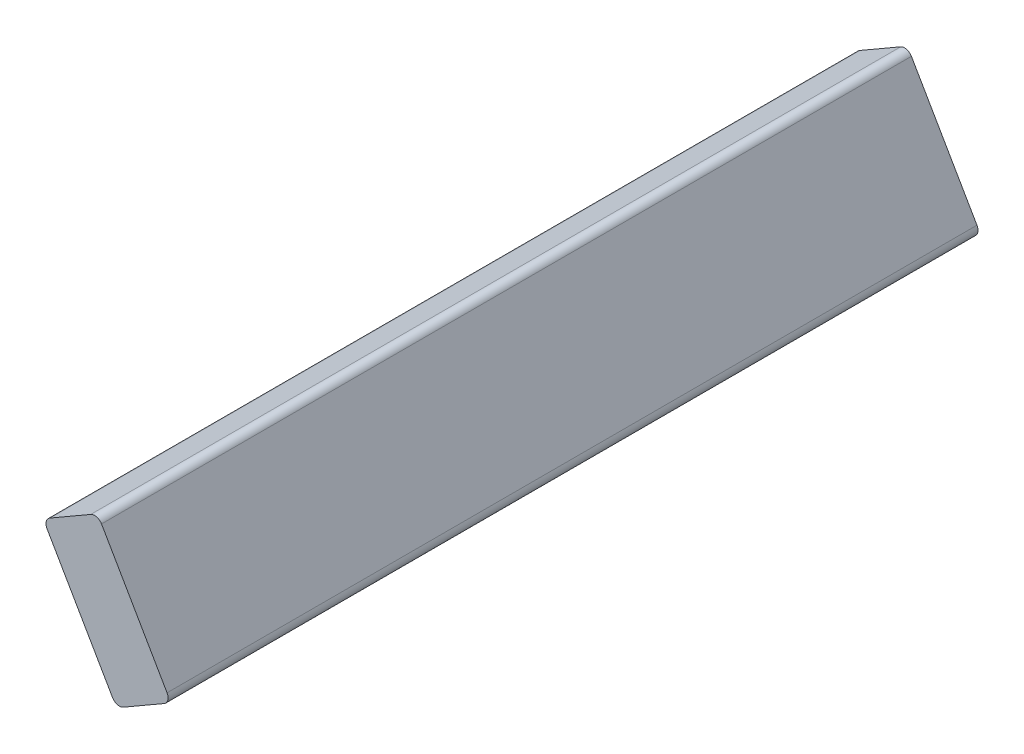
ISO-10303-21;
HEADER;
FILE_DESCRIPTION(('STEP AP214'),'2;1');
FILE_NAME('part.step','',(''),(''),'','','');
FILE_SCHEMA(('AUTOMOTIVE_DESIGN { 1 0 10303 214 1 1 1 1 }'));
ENDSEC;
DATA;
#1=APPLICATION_CONTEXT('core data for automotive mechanical design processes');
#2=APPLICATION_PROTOCOL_DEFINITION('international standard','automotive_design',2000,#1);
#3=PRODUCT_CONTEXT('',#1,'mechanical');
#4=PRODUCT('Part','Part','',(#3));
#5=PRODUCT_RELATED_PRODUCT_CATEGORY('part','',(#4));
#6=PRODUCT_DEFINITION_FORMATION('','',#4);
#7=PRODUCT_DEFINITION_CONTEXT('part definition',#1,'design');
#8=PRODUCT_DEFINITION('design','',#6,#7);
#9=PRODUCT_DEFINITION_SHAPE('','',#8);
#10=(LENGTH_UNIT() NAMED_UNIT(*) SI_UNIT(.MILLI.,.METRE.));
#11=(NAMED_UNIT(*) PLANE_ANGLE_UNIT() SI_UNIT($,.RADIAN.));
#12=(NAMED_UNIT(*) SI_UNIT($,.STERADIAN.) SOLID_ANGLE_UNIT());
#13=UNCERTAINTY_MEASURE_WITH_UNIT(LENGTH_MEASURE(1.E-05),#10,'distance_accuracy_value','');
#14=(GEOMETRIC_REPRESENTATION_CONTEXT(3) GLOBAL_UNCERTAINTY_ASSIGNED_CONTEXT((#13)) GLOBAL_UNIT_ASSIGNED_CONTEXT((#10,
#11,#12)) REPRESENTATION_CONTEXT('',''));
#15=CARTESIAN_POINT('',(0.,0.,0.));
#16=DIRECTION('',(0.,0.,1.));
#17=DIRECTION('',(1.,0.,0.));
#18=AXIS2_PLACEMENT_3D('',#15,#16,#17);
#19=CARTESIAN_POINT('',(0.,0.,0.));
#20=DIRECTION('',(0.,0.,1.));
#21=DIRECTION('',(1.,0.,0.));
#22=AXIS2_PLACEMENT_3D('',#19,#20,#21);
#23=PLANE('',#22);
#24=DIRECTION('',(0.866025403784439,0.5,0.));
#25=VECTOR('',#24,1.);
#26=CARTESIAN_POINT('',(227.693380196504,-470.576503047442,0.));
#27=LINE('',#26,#25);
#28=CARTESIAN_POINT('',(231.817826182027,-468.195253047442,0.));
#29=VERTEX_POINT('',#28);
#30=CARTESIAN_POINT('',(256.564502095168,-453.907753047442,0.));
#31=VERTEX_POINT('',#30);
#32=EDGE_CURVE('E106',#29,#31,#27,.T.);
#33=ORIENTED_EDGE('',*,*,#32,.F.);
#34=CARTESIAN_POINT('',(229.436576182027,-464.070807061918,0.));
#35=DIRECTION('',(0.,0.,1.));
#36=DIRECTION('',(1.,0.,0.));
#37=AXIS2_PLACEMENT_3D('',#34,#35,#36);
#38=CIRCLE('',#37,4.7625);
#39=CARTESIAN_POINT('',(225.312130196504,-466.452057061918,0.));
#40=VERTEX_POINT('',#39);
#41=EDGE_CURVE('E161',#29,#40,#38,.F.);
#42=ORIENTED_EDGE('',*,*,#41,.T.);
#43=DIRECTION('',(0.5,-0.866025403784439,0.));
#44=VECTOR('',#43,1.);
#45=CARTESIAN_POINT('',(227.693380196504,-470.576503047442,0.));
#46=LINE('',#45,#44);
#47=CARTESIAN_POINT('',(185.624630196504,-397.711290636529,0.));
#48=VERTEX_POINT('',#47);
#49=EDGE_CURVE('E146',#48,#40,#46,.T.);
#50=ORIENTED_EDGE('',*,*,#49,.F.);
#51=CARTESIAN_POINT('',(189.749076182027,-395.330040636529,0.));
#52=DIRECTION('',(0.,0.,1.));
#53=DIRECTION('',(1.,0.,0.));
#54=AXIS2_PLACEMENT_3D('',#51,#52,#53);
#55=CIRCLE('',#54,4.7625);
#56=CARTESIAN_POINT('',(187.367826182027,-391.205594651005,0.));
#57=VERTEX_POINT('',#56);
#58=EDGE_CURVE('E159',#48,#57,#55,.F.);
#59=ORIENTED_EDGE('',*,*,#58,.T.);
#60=DIRECTION('',(-0.866025403784438,-0.5,0.));
#61=VECTOR('',#60,1.);
#62=CARTESIAN_POINT('',(183.243380196504,-393.586844651005,0.));
#63=LINE('',#62,#61);
#64=CARTESIAN_POINT('',(212.114502095168,-376.918094651005,0.));
#65=VERTEX_POINT('',#64);
#66=EDGE_CURVE('E144',#65,#57,#63,.T.);
#67=ORIENTED_EDGE('',*,*,#66,.F.);
#68=CARTESIAN_POINT('',(214.495752095167,-381.042540636529,0.));
#69=DIRECTION('',(0.,0.,1.));
#70=DIRECTION('',(1.,0.,0.));
#71=AXIS2_PLACEMENT_3D('',#68,#69,#70);
#72=CIRCLE('',#71,4.7625);
#73=CARTESIAN_POINT('',(218.620198080691,-378.661290636529,0.));
#74=VERTEX_POINT('',#73);
#75=EDGE_CURVE('E143',#65,#74,#72,.F.);
#76=ORIENTED_EDGE('',*,*,#75,.T.);
#77=DIRECTION('',(-0.5,0.866025403784439,0.));
#78=VECTOR('',#77,1.);
#79=CARTESIAN_POINT('',(260.688948080691,-451.526503047442,0.));
#80=LINE('',#79,#78);
#81=CARTESIAN_POINT('',(258.307698080691,-447.402057061918,0.));
#82=VERTEX_POINT('',#81);
#83=EDGE_CURVE('E138',#82,#74,#80,.T.);
#84=ORIENTED_EDGE('',*,*,#83,.F.);
#85=CARTESIAN_POINT('',(254.183252095168,-449.783307061918,0.));
#86=DIRECTION('',(0.,0.,1.));
#87=DIRECTION('',(1.,0.,0.));
#88=AXIS2_PLACEMENT_3D('',#85,#86,#87);
#89=CIRCLE('',#88,4.7625);
#90=EDGE_CURVE('E141',#82,#31,#89,.F.);
#91=ORIENTED_EDGE('',*,*,#90,.T.);
#92=EDGE_LOOP('',(#33,#42,#50,#59,#67,#76,#84,#91));
#93=FACE_BOUND('',#92,.T.);
#94=ADVANCED_FACE('F32',(#93),#23,.F.);
#95=CARTESIAN_POINT('',(227.693380196504,-470.576503047442,613.913128567367));
#96=DIRECTION('',(0.866025403784439,0.5,0.));
#97=DIRECTION('',(-0.5,0.866025403784439,0.));
#98=AXIS2_PLACEMENT_3D('',#95,#96,#97);
#99=PLANE('',#98);
#100=ORIENTED_EDGE('',*,*,#49,.T.);
#101=DIRECTION('',(0.,0.,-1.));
#102=VECTOR('',#101,1.);
#103=CARTESIAN_POINT('',(225.312130196504,-466.452057061918,613.913128567367));
#104=LINE('',#103,#102);
#105=CARTESIAN_POINT('',(225.312130196504,-466.452057061918,490.53796101));
#106=VERTEX_POINT('',#105);
#107=EDGE_CURVE('E121',#40,#106,#104,.F.);
#108=ORIENTED_EDGE('',*,*,#107,.T.);
#109=DIRECTION('',(-0.5,0.866025403784439,0.));
#110=VECTOR('',#109,1.);
#111=CARTESIAN_POINT('',(227.693380196504,-470.576503047442,490.53796101));
#112=LINE('',#111,#110);
#113=CARTESIAN_POINT('',(185.624630196504,-397.711290636529,490.53796101));
#114=VERTEX_POINT('',#113);
#115=EDGE_CURVE('E152',#106,#114,#112,.T.);
#116=ORIENTED_EDGE('',*,*,#115,.T.);
#117=DIRECTION('',(0.,0.,-1.));
#118=VECTOR('',#117,1.);
#119=CARTESIAN_POINT('',(185.624630196504,-397.711290636529,613.913128567367));
#120=LINE('',#119,#118);
#121=EDGE_CURVE('E125',#114,#48,#120,.T.);
#122=ORIENTED_EDGE('',*,*,#121,.T.);
#123=EDGE_LOOP('',(#100,#108,#116,#122));
#124=FACE_BOUND('',#123,.T.);
#125=ADVANCED_FACE('F166',(#124),#99,.F.);
#126=CARTESIAN_POINT('',(183.243380196504,-393.586844651005,613.913128567367));
#127=DIRECTION('',(0.5,-0.866025403784438,0.));
#128=DIRECTION('',(0.866025403784439,0.5,0.));
#129=AXIS2_PLACEMENT_3D('',#126,#127,#128);
#130=PLANE('',#129);
#131=ORIENTED_EDGE('',*,*,#66,.T.);
#132=DIRECTION('',(0.,0.,-1.));
#133=VECTOR('',#132,1.);
#134=CARTESIAN_POINT('',(187.367826182027,-391.205594651005,613.913128567367));
#135=LINE('',#134,#133);
#136=CARTESIAN_POINT('',(187.367826182027,-391.205594651005,490.53796101));
#137=VERTEX_POINT('',#136);
#138=EDGE_CURVE('E54',#57,#137,#135,.F.);
#139=ORIENTED_EDGE('',*,*,#138,.T.);
#140=DIRECTION('',(0.866025403784439,0.5,0.));
#141=VECTOR('',#140,1.);
#142=CARTESIAN_POINT('',(183.243380196504,-393.586844651005,490.53796101));
#143=LINE('',#142,#141);
#144=CARTESIAN_POINT('',(212.114502095168,-376.918094651005,490.53796101));
#145=VERTEX_POINT('',#144);
#146=EDGE_CURVE('E154',#137,#145,#143,.T.);
#147=ORIENTED_EDGE('',*,*,#146,.T.);
#148=DIRECTION('',(0.,0.,-1.));
#149=VECTOR('',#148,1.);
#150=CARTESIAN_POINT('',(212.114502095168,-376.918094651005,613.913128567367));
#151=LINE('',#150,#149);
#152=EDGE_CURVE('E131',#145,#65,#151,.T.);
#153=ORIENTED_EDGE('',*,*,#152,.T.);
#154=EDGE_LOOP('',(#131,#139,#147,#153));
#155=FACE_BOUND('',#154,.T.);
#156=ADVANCED_FACE('F187',(#155),#130,.F.);
#157=CARTESIAN_POINT('',(260.688948080691,-451.526503047442,613.913128567367));
#158=DIRECTION('',(-0.866025403784439,-0.5,0.));
#159=DIRECTION('',(0.5,-0.866025403784439,0.));
#160=AXIS2_PLACEMENT_3D('',#157,#158,#159);
#161=PLANE('',#160);
#162=ORIENTED_EDGE('',*,*,#83,.T.);
#163=DIRECTION('',(0.,0.,-1.));
#164=VECTOR('',#163,1.);
#165=CARTESIAN_POINT('',(218.620198080691,-378.661290636529,613.913128567367));
#166=LINE('',#165,#164);
#167=CARTESIAN_POINT('',(218.620198080691,-378.661290636529,490.53796101));
#168=VERTEX_POINT('',#167);
#169=EDGE_CURVE('E11',#74,#168,#166,.F.);
#170=ORIENTED_EDGE('',*,*,#169,.T.);
#171=DIRECTION('',(0.5,-0.866025403784439,0.));
#172=VECTOR('',#171,1.);
#173=CARTESIAN_POINT('',(260.688948080691,-451.526503047442,490.53796101));
#174=LINE('',#173,#172);
#175=CARTESIAN_POINT('',(258.307698080691,-447.402057061918,490.53796101));
#176=VERTEX_POINT('',#175);
#177=EDGE_CURVE('E117',#168,#176,#174,.T.);
#178=ORIENTED_EDGE('',*,*,#177,.T.);
#179=DIRECTION('',(0.,0.,-1.));
#180=VECTOR('',#179,1.);
#181=CARTESIAN_POINT('',(258.307698080691,-447.402057061918,613.913128567367));
#182=LINE('',#181,#180);
#183=EDGE_CURVE('E40',#176,#82,#182,.T.);
#184=ORIENTED_EDGE('',*,*,#183,.T.);
#185=EDGE_LOOP('',(#162,#170,#178,#184));
#186=FACE_BOUND('',#185,.T.);
#187=ADVANCED_FACE('F137',(#186),#161,.F.);
#188=CARTESIAN_POINT('',(227.693380196504,-470.576503047442,613.913128567367));
#189=DIRECTION('',(-0.5,0.866025403784439,0.));
#190=DIRECTION('',(-0.866025403784439,-0.5,0.));
#191=AXIS2_PLACEMENT_3D('',#188,#189,#190);
#192=PLANE('',#191);
#193=DIRECTION('',(-0.866025403784439,-0.5,0.));
#194=VECTOR('',#193,1.);
#195=CARTESIAN_POINT('',(227.693380196504,-470.576503047442,490.53796101));
#196=LINE('',#195,#194);
#197=CARTESIAN_POINT('',(256.564502095168,-453.907753047442,490.53796101));
#198=VERTEX_POINT('',#197);
#199=CARTESIAN_POINT('',(231.817826182027,-468.195253047442,490.53796101));
#200=VERTEX_POINT('',#199);
#201=EDGE_CURVE('E103',#198,#200,#196,.T.);
#202=ORIENTED_EDGE('',*,*,#201,.T.);
#203=DIRECTION('',(0.,0.,-1.));
#204=VECTOR('',#203,1.);
#205=CARTESIAN_POINT('',(231.817826182027,-468.195253047442,613.913128567367));
#206=LINE('',#205,#204);
#207=EDGE_CURVE('E109',#200,#29,#206,.T.);
#208=ORIENTED_EDGE('',*,*,#207,.T.);
#209=ORIENTED_EDGE('',*,*,#32,.T.);
#210=DIRECTION('',(0.,0.,-1.));
#211=VECTOR('',#210,1.);
#212=CARTESIAN_POINT('',(256.564502095168,-453.907753047442,613.913128567367));
#213=LINE('',#212,#211);
#214=EDGE_CURVE('E99',#31,#198,#213,.F.);
#215=ORIENTED_EDGE('',*,*,#214,.T.);
#216=EDGE_LOOP('',(#202,#208,#209,#215));
#217=FACE_BOUND('',#216,.T.);
#218=ADVANCED_FACE('F101',(#217),#192,.F.);
#219=CARTESIAN_POINT('',(0.,0.,490.53796101));
#220=DIRECTION('',(0.,0.,-1.));
#221=DIRECTION('',(0.,1.,0.));
#222=AXIS2_PLACEMENT_3D('',#219,#220,#221);
#223=PLANE('',#222);
#224=ORIENTED_EDGE('',*,*,#115,.F.);
#225=CARTESIAN_POINT('',(229.436576182027,-464.070807061918,490.53796101));
#226=DIRECTION('',(0.,0.,-1.));
#227=DIRECTION('',(-1.,0.,0.));
#228=AXIS2_PLACEMENT_3D('',#225,#226,#227);
#229=CIRCLE('',#228,4.7625);
#230=EDGE_CURVE('E116',#106,#200,#229,.F.);
#231=ORIENTED_EDGE('',*,*,#230,.T.);
#232=ORIENTED_EDGE('',*,*,#201,.F.);
#233=CARTESIAN_POINT('',(254.183252095168,-449.783307061918,490.53796101));
#234=DIRECTION('',(0.,0.,-1.));
#235=DIRECTION('',(-1.,0.,0.));
#236=AXIS2_PLACEMENT_3D('',#233,#234,#235);
#237=CIRCLE('',#236,4.7625);
#238=EDGE_CURVE('E113',#198,#176,#237,.F.);
#239=ORIENTED_EDGE('',*,*,#238,.T.);
#240=ORIENTED_EDGE('',*,*,#177,.F.);
#241=CARTESIAN_POINT('',(214.495752095167,-381.042540636529,490.53796101));
#242=DIRECTION('',(0.,0.,-1.));
#243=DIRECTION('',(-1.,0.,0.));
#244=AXIS2_PLACEMENT_3D('',#241,#242,#243);
#245=CIRCLE('',#244,4.7625);
#246=EDGE_CURVE('E47',#168,#145,#245,.F.);
#247=ORIENTED_EDGE('',*,*,#246,.T.);
#248=ORIENTED_EDGE('',*,*,#146,.F.);
#249=CARTESIAN_POINT('',(189.749076182027,-395.330040636529,490.53796101));
#250=DIRECTION('',(0.,0.,-1.));
#251=DIRECTION('',(-1.,0.,0.));
#252=AXIS2_PLACEMENT_3D('',#249,#250,#251);
#253=CIRCLE('',#252,4.7625);
#254=EDGE_CURVE('E123',#137,#114,#253,.F.);
#255=ORIENTED_EDGE('',*,*,#254,.T.);
#256=EDGE_LOOP('',(#224,#231,#232,#239,#240,#247,#248,#255));
#257=FACE_BOUND('',#256,.T.);
#258=ADVANCED_FACE('F112',(#257),#223,.F.);
#259=CARTESIAN_POINT('',(229.436576182027,-464.070807061918,613.913128567367));
#260=DIRECTION('',(0.,0.,-1.));
#261=DIRECTION('',(-1.,0.,0.));
#262=AXIS2_PLACEMENT_3D('',#259,#260,#261);
#263=CYLINDRICAL_SURFACE('',#262,4.7625);
#264=ORIENTED_EDGE('',*,*,#230,.F.);
#265=ORIENTED_EDGE('',*,*,#107,.F.);
#266=ORIENTED_EDGE('',*,*,#41,.F.);
#267=ORIENTED_EDGE('',*,*,#207,.F.);
#268=EDGE_LOOP('',(#264,#265,#266,#267));
#269=FACE_BOUND('',#268,.T.);
#270=ADVANCED_FACE('F171',(#269),#263,.T.);
#271=CARTESIAN_POINT('',(189.749076182027,-395.330040636529,613.913128567367));
#272=DIRECTION('',(0.,0.,-1.));
#273=DIRECTION('',(-1.,0.,0.));
#274=AXIS2_PLACEMENT_3D('',#271,#272,#273);
#275=CYLINDRICAL_SURFACE('',#274,4.7625);
#276=ORIENTED_EDGE('',*,*,#254,.F.);
#277=ORIENTED_EDGE('',*,*,#138,.F.);
#278=ORIENTED_EDGE('',*,*,#58,.F.);
#279=ORIENTED_EDGE('',*,*,#121,.F.);
#280=EDGE_LOOP('',(#276,#277,#278,#279));
#281=FACE_BOUND('',#280,.T.);
#282=ADVANCED_FACE('F172',(#281),#275,.T.);
#283=CARTESIAN_POINT('',(214.495752095167,-381.042540636529,613.913128567367));
#284=DIRECTION('',(0.,0.,-1.));
#285=DIRECTION('',(-1.,0.,0.));
#286=AXIS2_PLACEMENT_3D('',#283,#284,#285);
#287=CYLINDRICAL_SURFACE('',#286,4.7625);
#288=ORIENTED_EDGE('',*,*,#246,.F.);
#289=ORIENTED_EDGE('',*,*,#169,.F.);
#290=ORIENTED_EDGE('',*,*,#75,.F.);
#291=ORIENTED_EDGE('',*,*,#152,.F.);
#292=EDGE_LOOP('',(#288,#289,#290,#291));
#293=FACE_BOUND('',#292,.T.);
#294=ADVANCED_FACE('F174',(#293),#287,.T.);
#295=CARTESIAN_POINT('',(254.183252095168,-449.783307061918,613.913128567367));
#296=DIRECTION('',(0.,0.,-1.));
#297=DIRECTION('',(-1.,0.,0.));
#298=AXIS2_PLACEMENT_3D('',#295,#296,#297);
#299=CYLINDRICAL_SURFACE('',#298,4.7625);
#300=ORIENTED_EDGE('',*,*,#238,.F.);
#301=ORIENTED_EDGE('',*,*,#214,.F.);
#302=ORIENTED_EDGE('',*,*,#90,.F.);
#303=ORIENTED_EDGE('',*,*,#183,.F.);
#304=EDGE_LOOP('',(#300,#301,#302,#303));
#305=FACE_BOUND('',#304,.T.);
#306=ADVANCED_FACE('F34',(#305),#299,.T.);
#307=CLOSED_SHELL('',(#94,#125,#156,#187,#218,#258,#270,#282,#294,#306));
#308=MANIFOLD_SOLID_BREP('B2',#307);
#309=ADVANCED_BREP_SHAPE_REPRESENTATION('',(#18,#308),#14);
#310=SHAPE_DEFINITION_REPRESENTATION(#9,#309);
ENDSEC;
END-ISO-10303-21;
